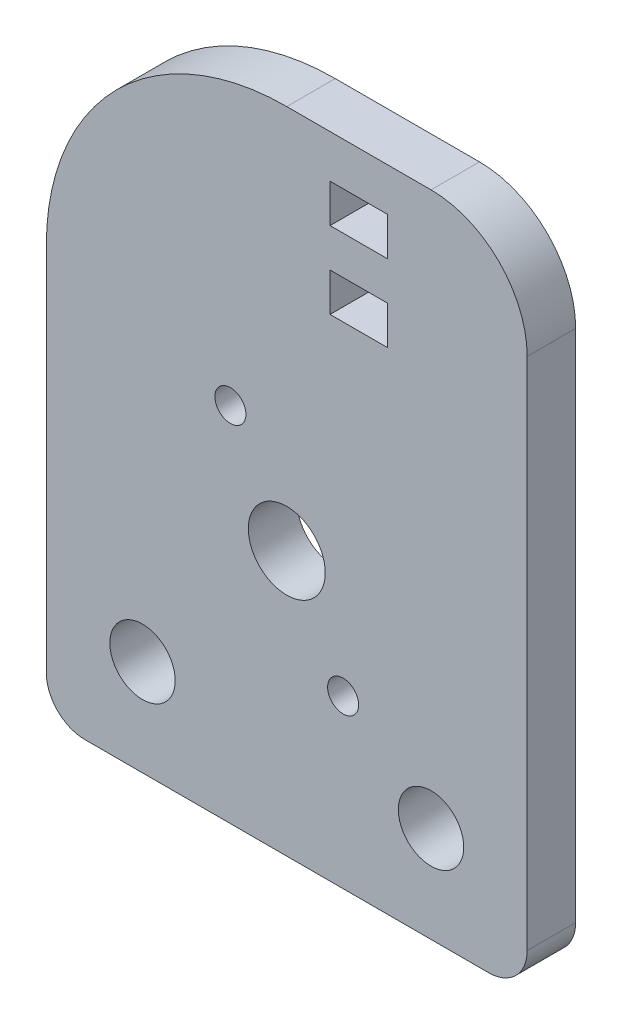
ISO-10303-21;
HEADER;
FILE_DESCRIPTION(('STEP AP214'),'2;1');
FILE_NAME('part.step','',(''),(''),'','','');
FILE_SCHEMA(('AUTOMOTIVE_DESIGN { 1 0 10303 214 1 1 1 1 }'));
ENDSEC;
DATA;
#1=APPLICATION_CONTEXT('core data for automotive mechanical design processes');
#2=APPLICATION_PROTOCOL_DEFINITION('international standard','automotive_design',2000,#1);
#3=PRODUCT_CONTEXT('',#1,'mechanical');
#4=PRODUCT('Part','Part','',(#3));
#5=PRODUCT_RELATED_PRODUCT_CATEGORY('part','',(#4));
#6=PRODUCT_DEFINITION_FORMATION('','',#4);
#7=PRODUCT_DEFINITION_CONTEXT('part definition',#1,'design');
#8=PRODUCT_DEFINITION('design','',#6,#7);
#9=PRODUCT_DEFINITION_SHAPE('','',#8);
#10=(LENGTH_UNIT() NAMED_UNIT(*) SI_UNIT(.MILLI.,.METRE.));
#11=(NAMED_UNIT(*) PLANE_ANGLE_UNIT() SI_UNIT($,.RADIAN.));
#12=(NAMED_UNIT(*) SI_UNIT($,.STERADIAN.) SOLID_ANGLE_UNIT());
#13=UNCERTAINTY_MEASURE_WITH_UNIT(LENGTH_MEASURE(1.E-05),#10,'distance_accuracy_value','');
#14=(GEOMETRIC_REPRESENTATION_CONTEXT(3) GLOBAL_UNCERTAINTY_ASSIGNED_CONTEXT((#13)) GLOBAL_UNIT_ASSIGNED_CONTEXT((#10,
#11,#12)) REPRESENTATION_CONTEXT('',''));
#15=CARTESIAN_POINT('',(0.,0.,0.));
#16=DIRECTION('',(0.,0.,1.));
#17=DIRECTION('',(1.,0.,0.));
#18=AXIS2_PLACEMENT_3D('',#15,#16,#17);
#19=CARTESIAN_POINT('',(0.,9.52500000000003,3.2004));
#20=DIRECTION('',(0.,0.,1.));
#21=DIRECTION('',(1.,0.,0.));
#22=AXIS2_PLACEMENT_3D('',#19,#20,#21);
#23=PLANE('',#22);
#24=DIRECTION('',(0.,-1.,0.));
#25=VECTOR('',#24,1.);
#26=CARTESIAN_POINT('',(2.85749999999999,22.5627854540451,3.2004));
#27=LINE('',#26,#25);
#28=CARTESIAN_POINT('',(2.85749999999999,22.5627854540451,3.2004));
#29=VERTEX_POINT('',#28);
#30=CARTESIAN_POINT('',(2.85749999999999,20.0227854540451,3.2004));
#31=VERTEX_POINT('',#30);
#32=EDGE_CURVE('E48',#29,#31,#27,.T.);
#33=ORIENTED_EDGE('',*,*,#32,.F.);
#34=DIRECTION('',(-1.,0.,0.));
#35=VECTOR('',#34,1.);
#36=CARTESIAN_POINT('',(2.85749999999999,22.5627854540451,3.2004));
#37=LINE('',#36,#35);
#38=CARTESIAN_POINT('',(6.66749999999999,22.5627854540451,3.2004));
#39=VERTEX_POINT('',#38);
#40=EDGE_CURVE('E169',#39,#29,#37,.T.);
#41=ORIENTED_EDGE('',*,*,#40,.F.);
#42=DIRECTION('',(0.,1.,0.));
#43=VECTOR('',#42,1.);
#44=CARTESIAN_POINT('',(6.66749999999999,22.5627854540451,3.2004));
#45=LINE('',#44,#43);
#46=CARTESIAN_POINT('',(6.66749999999999,20.0227854540451,3.2004));
#47=VERTEX_POINT('',#46);
#48=EDGE_CURVE('E153',#47,#39,#45,.T.);
#49=ORIENTED_EDGE('',*,*,#48,.F.);
#50=DIRECTION('',(1.,0.,0.));
#51=VECTOR('',#50,1.);
#52=CARTESIAN_POINT('',(2.85749999999999,20.0227854540451,3.2004));
#53=LINE('',#52,#51);
#54=EDGE_CURVE('E163',#31,#47,#53,.T.);
#55=ORIENTED_EDGE('',*,*,#54,.F.);
#56=EDGE_LOOP('',(#33,#41,#49,#55));
#57=FACE_BOUND('',#56,.T.);
#58=DIRECTION('',(0.,-1.,0.));
#59=VECTOR('',#58,1.);
#60=CARTESIAN_POINT('',(2.85749999999999,17.4827854540451,3.2004));
#61=LINE('',#60,#59);
#62=CARTESIAN_POINT('',(2.85749999999999,17.4827854540451,3.2004));
#63=VERTEX_POINT('',#62);
#64=CARTESIAN_POINT('',(2.85749999999999,14.9427854540451,3.2004));
#65=VERTEX_POINT('',#64);
#66=EDGE_CURVE('E56',#63,#65,#61,.T.);
#67=ORIENTED_EDGE('',*,*,#66,.F.);
#68=DIRECTION('',(-1.,0.,0.));
#69=VECTOR('',#68,1.);
#70=CARTESIAN_POINT('',(2.85749999999999,17.4827854540451,3.2004));
#71=LINE('',#70,#69);
#72=CARTESIAN_POINT('',(6.66749999999999,17.4827854540451,3.2004));
#73=VERTEX_POINT('',#72);
#74=EDGE_CURVE('E198',#73,#63,#71,.T.);
#75=ORIENTED_EDGE('',*,*,#74,.F.);
#76=DIRECTION('',(0.,1.,0.));
#77=VECTOR('',#76,1.);
#78=CARTESIAN_POINT('',(6.66749999999999,17.4827854540451,3.2004));
#79=LINE('',#78,#77);
#80=CARTESIAN_POINT('',(6.66749999999999,14.9427854540451,3.2004));
#81=VERTEX_POINT('',#80);
#82=EDGE_CURVE('E195',#81,#73,#79,.T.);
#83=ORIENTED_EDGE('',*,*,#82,.F.);
#84=DIRECTION('',(1.,0.,0.));
#85=VECTOR('',#84,1.);
#86=CARTESIAN_POINT('',(2.85749999999999,14.9427854540451,3.2004));
#87=LINE('',#86,#85);
#88=EDGE_CURVE('E192',#65,#81,#87,.T.);
#89=ORIENTED_EDGE('',*,*,#88,.F.);
#90=EDGE_LOOP('',(#67,#75,#83,#89));
#91=FACE_BOUND('',#90,.T.);
#92=CARTESIAN_POINT('',(-3.72109999999999,6.44513426004456,3.2004));
#93=DIRECTION('',(0.,0.,1.));
#94=DIRECTION('',(1.,0.,0.));
#95=AXIS2_PLACEMENT_3D('',#92,#93,#94);
#96=CIRCLE('',#95,1.025);
#97=CARTESIAN_POINT('',(-2.69609999999999,6.44513426004456,3.2004));
#98=VERTEX_POINT('',#97);
#99=EDGE_CURVE('E209',#98,#98,#96,.T.);
#100=ORIENTED_EDGE('',*,*,#99,.F.);
#101=EDGE_LOOP('',(#100));
#102=FACE_BOUND('',#101,.T.);
#103=CARTESIAN_POINT('',(3.72109999999999,-6.44513426004456,3.2004));
#104=DIRECTION('',(0.,0.,1.));
#105=DIRECTION('',(1.,0.,0.));
#106=AXIS2_PLACEMENT_3D('',#103,#104,#105);
#107=CIRCLE('',#106,1.025);
#108=CARTESIAN_POINT('',(4.74609999999999,-6.44513426004456,3.2004));
#109=VERTEX_POINT('',#108);
#110=EDGE_CURVE('E180',#109,#109,#107,.T.);
#111=ORIENTED_EDGE('',*,*,#110,.F.);
#112=EDGE_LOOP('',(#111));
#113=FACE_BOUND('',#112,.T.);
#114=CARTESIAN_POINT('',(-9.525,-11.1125,3.2004));
#115=DIRECTION('',(0.,0.,1.));
#116=DIRECTION('',(1.,0.,0.));
#117=AXIS2_PLACEMENT_3D('',#114,#115,#116);
#118=CIRCLE('',#117,2.159);
#119=CARTESIAN_POINT('',(-7.366,-11.1125,3.2004));
#120=VERTEX_POINT('',#119);
#121=EDGE_CURVE('E227',#120,#120,#118,.T.);
#122=ORIENTED_EDGE('',*,*,#121,.F.);
#123=EDGE_LOOP('',(#122));
#124=FACE_BOUND('',#123,.T.);
#125=DIRECTION('',(0.,-1.,0.));
#126=VECTOR('',#125,1.);
#127=CARTESIAN_POINT('',(-15.875,9.525,3.2004));
#128=LINE('',#127,#126);
#129=CARTESIAN_POINT('',(-15.875,9.525,3.2004));
#130=VERTEX_POINT('',#129);
#131=CARTESIAN_POINT('',(-15.875,-14.9225,3.2004));
#132=VERTEX_POINT('',#131);
#133=EDGE_CURVE('E246',#130,#132,#128,.T.);
#134=ORIENTED_EDGE('',*,*,#133,.T.);
#135=CARTESIAN_POINT('',(-13.335,-14.9225,3.2004));
#136=DIRECTION('',(0.,0.,1.));
#137=DIRECTION('',(1.,0.,0.));
#138=AXIS2_PLACEMENT_3D('',#135,#136,#137);
#139=CIRCLE('',#138,2.54);
#140=CARTESIAN_POINT('',(-13.335,-17.4625,3.2004));
#141=VERTEX_POINT('',#140);
#142=EDGE_CURVE('E41',#132,#141,#139,.T.);
#143=ORIENTED_EDGE('',*,*,#142,.T.);
#144=DIRECTION('',(1.,0.,0.));
#145=VECTOR('',#144,1.);
#146=CARTESIAN_POINT('',(-15.875,-17.4625,3.2004));
#147=LINE('',#146,#145);
#148=CARTESIAN_POINT('',(13.335,-17.4625,3.2004));
#149=VERTEX_POINT('',#148);
#150=EDGE_CURVE('E249',#141,#149,#147,.T.);
#151=ORIENTED_EDGE('',*,*,#150,.T.);
#152=CARTESIAN_POINT('',(13.335,-14.9225,3.2004));
#153=DIRECTION('',(0.,0.,1.));
#154=DIRECTION('',(1.,0.,0.));
#155=AXIS2_PLACEMENT_3D('',#152,#153,#154);
#156=CIRCLE('',#155,2.54);
#157=CARTESIAN_POINT('',(15.875,-14.9225,3.2004));
#158=VERTEX_POINT('',#157);
#159=EDGE_CURVE('E290',#149,#158,#156,.T.);
#160=ORIENTED_EDGE('',*,*,#159,.T.);
#161=DIRECTION('',(0.,1.,0.));
#162=VECTOR('',#161,1.);
#163=CARTESIAN_POINT('',(15.875,9.525,3.2004));
#164=LINE('',#163,#162);
#165=CARTESIAN_POINT('',(15.875,19.05,3.2004));
#166=VERTEX_POINT('',#165);
#167=EDGE_CURVE('E239',#158,#166,#164,.T.);
#168=ORIENTED_EDGE('',*,*,#167,.T.);
#169=CARTESIAN_POINT('',(9.525,19.05,3.2004));
#170=DIRECTION('',(0.,0.,1.));
#171=DIRECTION('',(1.,0.,0.));
#172=AXIS2_PLACEMENT_3D('',#169,#170,#171);
#173=CIRCLE('',#172,6.35);
#174=CARTESIAN_POINT('',(9.525,25.4,3.2004));
#175=VERTEX_POINT('',#174);
#176=EDGE_CURVE('E277',#166,#175,#173,.T.);
#177=ORIENTED_EDGE('',*,*,#176,.T.);
#178=DIRECTION('',(-1.,0.,0.));
#179=VECTOR('',#178,1.);
#180=CARTESIAN_POINT('',(0.,25.4,3.2004));
#181=LINE('',#180,#179);
#182=CARTESIAN_POINT('',(0.,25.4,3.2004));
#183=VERTEX_POINT('',#182);
#184=EDGE_CURVE('E241',#175,#183,#181,.T.);
#185=ORIENTED_EDGE('',*,*,#184,.T.);
#186=CARTESIAN_POINT('',(0.,9.52500000000003,3.2004));
#187=DIRECTION('',(0.,0.,1.));
#188=DIRECTION('',(1.,0.,0.));
#189=AXIS2_PLACEMENT_3D('',#186,#187,#188);
#190=CIRCLE('',#189,15.875);
#191=EDGE_CURVE('E244',#183,#130,#190,.T.);
#192=ORIENTED_EDGE('',*,*,#191,.T.);
#193=EDGE_LOOP('',(#134,#143,#151,#160,#168,#177,#185,#192));
#194=FACE_BOUND('',#193,.T.);
#195=CARTESIAN_POINT('',(0.,0.,3.2004));
#196=DIRECTION('',(0.,0.,1.));
#197=DIRECTION('',(1.,0.,0.));
#198=AXIS2_PLACEMENT_3D('',#195,#196,#197);
#199=CIRCLE('',#198,2.54);
#200=CARTESIAN_POINT('',(2.54,0.,3.2004));
#201=VERTEX_POINT('',#200);
#202=EDGE_CURVE('E233',#201,#201,#199,.T.);
#203=ORIENTED_EDGE('',*,*,#202,.F.);
#204=EDGE_LOOP('',(#203));
#205=FACE_BOUND('',#204,.T.);
#206=CARTESIAN_POINT('',(9.525,-11.1125,3.2004));
#207=DIRECTION('',(0.,0.,1.));
#208=DIRECTION('',(1.,0.,0.));
#209=AXIS2_PLACEMENT_3D('',#206,#207,#208);
#210=CIRCLE('',#209,2.159);
#211=CARTESIAN_POINT('',(11.684,-11.1125,3.2004));
#212=VERTEX_POINT('',#211);
#213=EDGE_CURVE('E221',#212,#212,#210,.T.);
#214=ORIENTED_EDGE('',*,*,#213,.F.);
#215=EDGE_LOOP('',(#214));
#216=FACE_BOUND('',#215,.T.);
#217=ADVANCED_FACE('F33',(#57,#91,#102,#113,#124,#194,#205,#216),#23,.T.);
#218=CARTESIAN_POINT('',(0.,9.52500000000003,0.));
#219=DIRECTION('',(0.,0.,1.));
#220=DIRECTION('',(1.,0.,0.));
#221=AXIS2_PLACEMENT_3D('',#218,#219,#220);
#222=PLANE('',#221);
#223=DIRECTION('',(1.,0.,0.));
#224=VECTOR('',#223,1.);
#225=CARTESIAN_POINT('',(2.85749999999999,22.5627854540451,0.));
#226=LINE('',#225,#224);
#227=CARTESIAN_POINT('',(2.85749999999999,22.5627854540451,0.));
#228=VERTEX_POINT('',#227);
#229=CARTESIAN_POINT('',(6.66749999999999,22.5627854540451,0.));
#230=VERTEX_POINT('',#229);
#231=EDGE_CURVE('E408',#228,#230,#226,.T.);
#232=ORIENTED_EDGE('',*,*,#231,.F.);
#233=DIRECTION('',(0.,1.,0.));
#234=VECTOR('',#233,1.);
#235=CARTESIAN_POINT('',(2.85749999999999,22.5627854540451,0.));
#236=LINE('',#235,#234);
#237=CARTESIAN_POINT('',(2.85749999999999,20.0227854540451,0.));
#238=VERTEX_POINT('',#237);
#239=EDGE_CURVE('E181',#238,#228,#236,.T.);
#240=ORIENTED_EDGE('',*,*,#239,.F.);
#241=DIRECTION('',(-1.,0.,0.));
#242=VECTOR('',#241,1.);
#243=CARTESIAN_POINT('',(2.85749999999999,20.0227854540451,0.));
#244=LINE('',#243,#242);
#245=CARTESIAN_POINT('',(6.66749999999999,20.0227854540451,0.));
#246=VERTEX_POINT('',#245);
#247=EDGE_CURVE('E178',#246,#238,#244,.T.);
#248=ORIENTED_EDGE('',*,*,#247,.F.);
#249=DIRECTION('',(0.,-1.,0.));
#250=VECTOR('',#249,1.);
#251=CARTESIAN_POINT('',(6.66749999999999,22.5627854540451,0.));
#252=LINE('',#251,#250);
#253=EDGE_CURVE('E156',#230,#246,#252,.T.);
#254=ORIENTED_EDGE('',*,*,#253,.F.);
#255=EDGE_LOOP('',(#232,#240,#248,#254));
#256=FACE_BOUND('',#255,.T.);
#257=DIRECTION('',(1.,0.,0.));
#258=VECTOR('',#257,1.);
#259=CARTESIAN_POINT('',(2.85749999999999,17.4827854540451,0.));
#260=LINE('',#259,#258);
#261=CARTESIAN_POINT('',(2.85749999999999,17.4827854540451,0.));
#262=VERTEX_POINT('',#261);
#263=CARTESIAN_POINT('',(6.66749999999999,17.4827854540451,0.));
#264=VERTEX_POINT('',#263);
#265=EDGE_CURVE('E185',#262,#264,#260,.T.);
#266=ORIENTED_EDGE('',*,*,#265,.F.);
#267=DIRECTION('',(0.,1.,0.));
#268=VECTOR('',#267,1.);
#269=CARTESIAN_POINT('',(2.85749999999999,17.4827854540451,0.));
#270=LINE('',#269,#268);
#271=CARTESIAN_POINT('',(2.85749999999999,14.9427854540451,0.));
#272=VERTEX_POINT('',#271);
#273=EDGE_CURVE('E188',#272,#262,#270,.T.);
#274=ORIENTED_EDGE('',*,*,#273,.F.);
#275=DIRECTION('',(-1.,0.,0.));
#276=VECTOR('',#275,1.);
#277=CARTESIAN_POINT('',(2.85749999999999,14.9427854540451,0.));
#278=LINE('',#277,#276);
#279=CARTESIAN_POINT('',(6.66749999999999,14.9427854540451,0.));
#280=VERTEX_POINT('',#279);
#281=EDGE_CURVE('E190',#280,#272,#278,.T.);
#282=ORIENTED_EDGE('',*,*,#281,.F.);
#283=DIRECTION('',(0.,-1.,0.));
#284=VECTOR('',#283,1.);
#285=CARTESIAN_POINT('',(6.66749999999999,17.4827854540451,0.));
#286=LINE('',#285,#284);
#287=EDGE_CURVE('E182',#264,#280,#286,.T.);
#288=ORIENTED_EDGE('',*,*,#287,.F.);
#289=EDGE_LOOP('',(#266,#274,#282,#288));
#290=FACE_BOUND('',#289,.T.);
#291=CARTESIAN_POINT('',(-3.72109999999999,6.44513426004456,0.));
#292=DIRECTION('',(0.,0.,1.));
#293=DIRECTION('',(1.,0.,0.));
#294=AXIS2_PLACEMENT_3D('',#291,#292,#293);
#295=CIRCLE('',#294,1.025);
#296=CARTESIAN_POINT('',(-2.69609999999999,6.44513426004456,0.));
#297=VERTEX_POINT('',#296);
#298=EDGE_CURVE('E212',#297,#297,#295,.F.);
#299=ORIENTED_EDGE('',*,*,#298,.F.);
#300=EDGE_LOOP('',(#299));
#301=FACE_BOUND('',#300,.T.);
#302=CARTESIAN_POINT('',(3.72109999999999,-6.44513426004456,0.));
#303=DIRECTION('',(0.,0.,1.));
#304=DIRECTION('',(1.,0.,0.));
#305=AXIS2_PLACEMENT_3D('',#302,#303,#304);
#306=CIRCLE('',#305,1.025);
#307=CARTESIAN_POINT('',(4.74609999999999,-6.44513426004456,0.));
#308=VERTEX_POINT('',#307);
#309=EDGE_CURVE('E213',#308,#308,#306,.F.);
#310=ORIENTED_EDGE('',*,*,#309,.F.);
#311=EDGE_LOOP('',(#310));
#312=FACE_BOUND('',#311,.T.);
#313=DIRECTION('',(1.,0.,0.));
#314=VECTOR('',#313,1.);
#315=CARTESIAN_POINT('',(-15.875,-17.4625,0.));
#316=LINE('',#315,#314);
#317=CARTESIAN_POINT('',(-13.335,-17.4625,0.));
#318=VERTEX_POINT('',#317);
#319=CARTESIAN_POINT('',(13.335,-17.4625,0.));
#320=VERTEX_POINT('',#319);
#321=EDGE_CURVE('E242',#318,#320,#316,.T.);
#322=ORIENTED_EDGE('',*,*,#321,.F.);
#323=CARTESIAN_POINT('',(-13.335,-14.9225,0.));
#324=DIRECTION('',(0.,0.,1.));
#325=DIRECTION('',(1.,0.,0.));
#326=AXIS2_PLACEMENT_3D('',#323,#324,#325);
#327=CIRCLE('',#326,2.54);
#328=CARTESIAN_POINT('',(-15.875,-14.9225,0.));
#329=VERTEX_POINT('',#328);
#330=EDGE_CURVE('E286',#318,#329,#327,.F.);
#331=ORIENTED_EDGE('',*,*,#330,.T.);
#332=DIRECTION('',(0.,-1.,0.));
#333=VECTOR('',#332,1.);
#334=CARTESIAN_POINT('',(-15.875,9.525,0.));
#335=LINE('',#334,#333);
#336=CARTESIAN_POINT('',(-15.875,9.525,0.));
#337=VERTEX_POINT('',#336);
#338=EDGE_CURVE('E258',#337,#329,#335,.T.);
#339=ORIENTED_EDGE('',*,*,#338,.F.);
#340=CARTESIAN_POINT('',(0.,9.52500000000003,0.));
#341=DIRECTION('',(0.,0.,1.));
#342=DIRECTION('',(1.,0.,0.));
#343=AXIS2_PLACEMENT_3D('',#340,#341,#342);
#344=CIRCLE('',#343,15.875);
#345=CARTESIAN_POINT('',(0.,25.4,0.));
#346=VERTEX_POINT('',#345);
#347=EDGE_CURVE('E256',#346,#337,#344,.T.);
#348=ORIENTED_EDGE('',*,*,#347,.F.);
#349=DIRECTION('',(-1.,0.,0.));
#350=VECTOR('',#349,1.);
#351=CARTESIAN_POINT('',(0.,25.4,0.));
#352=LINE('',#351,#350);
#353=CARTESIAN_POINT('',(9.525,25.4,0.));
#354=VERTEX_POINT('',#353);
#355=EDGE_CURVE('E254',#354,#346,#352,.T.);
#356=ORIENTED_EDGE('',*,*,#355,.F.);
#357=CARTESIAN_POINT('',(9.525,19.05,0.));
#358=DIRECTION('',(0.,0.,1.));
#359=DIRECTION('',(1.,0.,0.));
#360=AXIS2_PLACEMENT_3D('',#357,#358,#359);
#361=CIRCLE('',#360,6.35);
#362=CARTESIAN_POINT('',(15.875,19.05,0.));
#363=VERTEX_POINT('',#362);
#364=EDGE_CURVE('E271',#354,#363,#361,.F.);
#365=ORIENTED_EDGE('',*,*,#364,.T.);
#366=DIRECTION('',(0.,1.,0.));
#367=VECTOR('',#366,1.);
#368=CARTESIAN_POINT('',(15.875,25.4,0.));
#369=LINE('',#368,#367);
#370=CARTESIAN_POINT('',(15.875,-14.9225,0.));
#371=VERTEX_POINT('',#370);
#372=EDGE_CURVE('E236',#371,#363,#369,.T.);
#373=ORIENTED_EDGE('',*,*,#372,.F.);
#374=CARTESIAN_POINT('',(13.335,-14.9225,0.));
#375=DIRECTION('',(0.,0.,1.));
#376=DIRECTION('',(1.,0.,0.));
#377=AXIS2_PLACEMENT_3D('',#374,#375,#376);
#378=CIRCLE('',#377,2.54);
#379=EDGE_CURVE('E284',#371,#320,#378,.F.);
#380=ORIENTED_EDGE('',*,*,#379,.T.);
#381=EDGE_LOOP('',(#322,#331,#339,#348,#356,#365,#373,#380));
#382=FACE_BOUND('',#381,.T.);
#383=CARTESIAN_POINT('',(0.,0.,0.));
#384=DIRECTION('',(0.,0.,1.));
#385=DIRECTION('',(1.,0.,0.));
#386=AXIS2_PLACEMENT_3D('',#383,#384,#385);
#387=CIRCLE('',#386,2.54);
#388=CARTESIAN_POINT('',(2.54,0.,0.));
#389=VERTEX_POINT('',#388);
#390=EDGE_CURVE('E230',#389,#389,#387,.T.);
#391=ORIENTED_EDGE('',*,*,#390,.T.);
#392=EDGE_LOOP('',(#391));
#393=FACE_BOUND('',#392,.T.);
#394=CARTESIAN_POINT('',(-9.525,-11.1125,0.));
#395=DIRECTION('',(0.,0.,1.));
#396=DIRECTION('',(1.,0.,0.));
#397=AXIS2_PLACEMENT_3D('',#394,#395,#396);
#398=CIRCLE('',#397,2.159);
#399=CARTESIAN_POINT('',(-7.366,-11.1125,0.));
#400=VERTEX_POINT('',#399);
#401=EDGE_CURVE('E224',#400,#400,#398,.T.);
#402=ORIENTED_EDGE('',*,*,#401,.T.);
#403=EDGE_LOOP('',(#402));
#404=FACE_BOUND('',#403,.T.);
#405=CARTESIAN_POINT('',(9.525,-11.1125,0.));
#406=DIRECTION('',(0.,0.,1.));
#407=DIRECTION('',(1.,0.,0.));
#408=AXIS2_PLACEMENT_3D('',#405,#406,#407);
#409=CIRCLE('',#408,2.159);
#410=CARTESIAN_POINT('',(11.684,-11.1125,0.));
#411=VERTEX_POINT('',#410);
#412=EDGE_CURVE('E216',#411,#411,#409,.T.);
#413=ORIENTED_EDGE('',*,*,#412,.T.);
#414=EDGE_LOOP('',(#413));
#415=FACE_BOUND('',#414,.T.);
#416=ADVANCED_FACE('F307',(#256,#290,#301,#312,#382,#393,#404,#415),#222,.F.);
#417=CARTESIAN_POINT('',(15.875,25.4,3.2004));
#418=DIRECTION('',(-1.,0.,0.));
#419=DIRECTION('',(0.,-1.,0.));
#420=AXIS2_PLACEMENT_3D('',#417,#418,#419);
#421=PLANE('',#420);
#422=ORIENTED_EDGE('',*,*,#167,.F.);
#423=DIRECTION('',(0.,0.,-1.));
#424=VECTOR('',#423,1.);
#425=CARTESIAN_POINT('',(15.875,-14.9225,3.2004));
#426=LINE('',#425,#424);
#427=EDGE_CURVE('E11',#158,#371,#426,.T.);
#428=ORIENTED_EDGE('',*,*,#427,.T.);
#429=ORIENTED_EDGE('',*,*,#372,.T.);
#430=DIRECTION('',(0.,0.,-1.));
#431=VECTOR('',#430,1.);
#432=CARTESIAN_POINT('',(15.875,19.05,3.2004));
#433=LINE('',#432,#431);
#434=EDGE_CURVE('E274',#363,#166,#433,.F.);
#435=ORIENTED_EDGE('',*,*,#434,.T.);
#436=EDGE_LOOP('',(#422,#428,#429,#435));
#437=FACE_BOUND('',#436,.T.);
#438=ADVANCED_FACE('F329',(#437),#421,.F.);
#439=CARTESIAN_POINT('',(0.,25.4,3.2004));
#440=DIRECTION('',(0.,-1.,0.));
#441=DIRECTION('',(0.,0.,-1.));
#442=AXIS2_PLACEMENT_3D('',#439,#440,#441);
#443=PLANE('',#442);
#444=ORIENTED_EDGE('',*,*,#184,.F.);
#445=DIRECTION('',(0.,0.,-1.));
#446=VECTOR('',#445,1.);
#447=CARTESIAN_POINT('',(9.525,25.4,3.2004));
#448=LINE('',#447,#446);
#449=EDGE_CURVE('E268',#175,#354,#448,.T.);
#450=ORIENTED_EDGE('',*,*,#449,.T.);
#451=ORIENTED_EDGE('',*,*,#355,.T.);
#452=DIRECTION('',(0.,0.,-1.));
#453=VECTOR('',#452,1.);
#454=CARTESIAN_POINT('',(0.,25.4,3.2004));
#455=LINE('',#454,#453);
#456=EDGE_CURVE('E265',#183,#346,#455,.T.);
#457=ORIENTED_EDGE('',*,*,#456,.F.);
#458=EDGE_LOOP('',(#444,#450,#451,#457));
#459=FACE_BOUND('',#458,.T.);
#460=ADVANCED_FACE('F322',(#459),#443,.F.);
#461=CARTESIAN_POINT('',(0.,9.52500000000003,3.2004));
#462=DIRECTION('',(0.,0.,-1.));
#463=DIRECTION('',(-1.,0.,0.));
#464=AXIS2_PLACEMENT_3D('',#461,#462,#463);
#465=CYLINDRICAL_SURFACE('',#464,15.875);
#466=ORIENTED_EDGE('',*,*,#347,.T.);
#467=DIRECTION('',(0.,0.,-1.));
#468=VECTOR('',#467,1.);
#469=CARTESIAN_POINT('',(-15.875,9.525,3.2004));
#470=LINE('',#469,#468);
#471=EDGE_CURVE('E252',#130,#337,#470,.T.);
#472=ORIENTED_EDGE('',*,*,#471,.F.);
#473=ORIENTED_EDGE('',*,*,#191,.F.);
#474=ORIENTED_EDGE('',*,*,#456,.T.);
#475=EDGE_LOOP('',(#466,#472,#473,#474));
#476=FACE_BOUND('',#475,.T.);
#477=ADVANCED_FACE('F315',(#476),#465,.T.);
#478=CARTESIAN_POINT('',(-15.875,9.525,3.2004));
#479=DIRECTION('',(1.,0.,0.));
#480=DIRECTION('',(0.,1.,0.));
#481=AXIS2_PLACEMENT_3D('',#478,#479,#480);
#482=PLANE('',#481);
#483=ORIENTED_EDGE('',*,*,#338,.T.);
#484=DIRECTION('',(0.,0.,-1.));
#485=VECTOR('',#484,1.);
#486=CARTESIAN_POINT('',(-15.875,-14.9225,3.2004));
#487=LINE('',#486,#485);
#488=EDGE_CURVE('E288',#329,#132,#487,.F.);
#489=ORIENTED_EDGE('',*,*,#488,.T.);
#490=ORIENTED_EDGE('',*,*,#133,.F.);
#491=ORIENTED_EDGE('',*,*,#471,.T.);
#492=EDGE_LOOP('',(#483,#489,#490,#491));
#493=FACE_BOUND('',#492,.T.);
#494=ADVANCED_FACE('F311',(#493),#482,.F.);
#495=CARTESIAN_POINT('',(-15.875,-17.4625,3.2004));
#496=DIRECTION('',(0.,1.,0.));
#497=DIRECTION('',(-1.,0.,0.));
#498=AXIS2_PLACEMENT_3D('',#495,#496,#497);
#499=PLANE('',#498);
#500=ORIENTED_EDGE('',*,*,#150,.F.);
#501=DIRECTION('',(0.,0.,-1.));
#502=VECTOR('',#501,1.);
#503=CARTESIAN_POINT('',(-13.335,-17.4625,3.2004));
#504=LINE('',#503,#502);
#505=EDGE_CURVE('E281',#141,#318,#504,.T.);
#506=ORIENTED_EDGE('',*,*,#505,.T.);
#507=ORIENTED_EDGE('',*,*,#321,.T.);
#508=DIRECTION('',(0.,0.,-1.));
#509=VECTOR('',#508,1.);
#510=CARTESIAN_POINT('',(13.335,-17.4625,3.2004));
#511=LINE('',#510,#509);
#512=EDGE_CURVE('E279',#320,#149,#511,.F.);
#513=ORIENTED_EDGE('',*,*,#512,.T.);
#514=EDGE_LOOP('',(#500,#506,#507,#513));
#515=FACE_BOUND('',#514,.T.);
#516=ADVANCED_FACE('F301',(#515),#499,.F.);
#517=CARTESIAN_POINT('',(0.,0.,3.2004));
#518=DIRECTION('',(0.,0.,-1.));
#519=DIRECTION('',(-1.,0.,0.));
#520=AXIS2_PLACEMENT_3D('',#517,#518,#519);
#521=CYLINDRICAL_SURFACE('',#520,2.54);
#522=ORIENTED_EDGE('',*,*,#202,.T.);
#523=EDGE_LOOP('',(#522));
#524=FACE_BOUND('',#523,.T.);
#525=ORIENTED_EDGE('',*,*,#390,.F.);
#526=EDGE_LOOP('',(#525));
#527=FACE_BOUND('',#526,.T.);
#528=ADVANCED_FACE('F349',(#524,#527),#521,.F.);
#529=CARTESIAN_POINT('',(-9.525,-11.1125,3.2004));
#530=DIRECTION('',(0.,0.,-1.));
#531=DIRECTION('',(-1.,0.,0.));
#532=AXIS2_PLACEMENT_3D('',#529,#530,#531);
#533=CYLINDRICAL_SURFACE('',#532,2.159);
#534=ORIENTED_EDGE('',*,*,#121,.T.);
#535=EDGE_LOOP('',(#534));
#536=FACE_BOUND('',#535,.T.);
#537=ORIENTED_EDGE('',*,*,#401,.F.);
#538=EDGE_LOOP('',(#537));
#539=FACE_BOUND('',#538,.T.);
#540=ADVANCED_FACE('F367',(#536,#539),#533,.F.);
#541=CARTESIAN_POINT('',(9.525,-11.1125,3.2004));
#542=DIRECTION('',(0.,0.,-1.));
#543=DIRECTION('',(-1.,0.,0.));
#544=AXIS2_PLACEMENT_3D('',#541,#542,#543);
#545=CYLINDRICAL_SURFACE('',#544,2.159);
#546=ORIENTED_EDGE('',*,*,#213,.T.);
#547=EDGE_LOOP('',(#546));
#548=FACE_BOUND('',#547,.T.);
#549=ORIENTED_EDGE('',*,*,#412,.F.);
#550=EDGE_LOOP('',(#549));
#551=FACE_BOUND('',#550,.T.);
#552=ADVANCED_FACE('F363',(#548,#551),#545,.F.);
#553=CARTESIAN_POINT('',(9.525,19.05,3.2004));
#554=DIRECTION('',(0.,0.,-1.));
#555=DIRECTION('',(-1.,0.,0.));
#556=AXIS2_PLACEMENT_3D('',#553,#554,#555);
#557=CYLINDRICAL_SURFACE('',#556,6.35);
#558=ORIENTED_EDGE('',*,*,#176,.F.);
#559=ORIENTED_EDGE('',*,*,#434,.F.);
#560=ORIENTED_EDGE('',*,*,#364,.F.);
#561=ORIENTED_EDGE('',*,*,#449,.F.);
#562=EDGE_LOOP('',(#558,#559,#560,#561));
#563=FACE_BOUND('',#562,.T.);
#564=ADVANCED_FACE('F326',(#563),#557,.T.);
#565=CARTESIAN_POINT('',(-13.335,-14.9225,3.2004));
#566=DIRECTION('',(0.,0.,-1.));
#567=DIRECTION('',(-1.,0.,0.));
#568=AXIS2_PLACEMENT_3D('',#565,#566,#567);
#569=CYLINDRICAL_SURFACE('',#568,2.54);
#570=ORIENTED_EDGE('',*,*,#142,.F.);
#571=ORIENTED_EDGE('',*,*,#488,.F.);
#572=ORIENTED_EDGE('',*,*,#330,.F.);
#573=ORIENTED_EDGE('',*,*,#505,.F.);
#574=EDGE_LOOP('',(#570,#571,#572,#573));
#575=FACE_BOUND('',#574,.T.);
#576=ADVANCED_FACE('F304',(#575),#569,.T.);
#577=CARTESIAN_POINT('',(13.335,-14.9225,3.2004));
#578=DIRECTION('',(0.,0.,-1.));
#579=DIRECTION('',(-1.,0.,0.));
#580=AXIS2_PLACEMENT_3D('',#577,#578,#579);
#581=CYLINDRICAL_SURFACE('',#580,2.54);
#582=ORIENTED_EDGE('',*,*,#159,.F.);
#583=ORIENTED_EDGE('',*,*,#512,.F.);
#584=ORIENTED_EDGE('',*,*,#379,.F.);
#585=ORIENTED_EDGE('',*,*,#427,.F.);
#586=EDGE_LOOP('',(#582,#583,#584,#585));
#587=FACE_BOUND('',#586,.T.);
#588=ADVANCED_FACE('F35',(#587),#581,.T.);
#589=CARTESIAN_POINT('',(3.72109999999999,-6.44513426004456,-2.89913780286484));
#590=DIRECTION('',(0.,0.,1.));
#591=DIRECTION('',(1.,0.,0.));
#592=AXIS2_PLACEMENT_3D('',#589,#590,#591);
#593=CYLINDRICAL_SURFACE('',#592,1.025);
#594=ORIENTED_EDGE('',*,*,#309,.T.);
#595=EDGE_LOOP('',(#594));
#596=FACE_BOUND('',#595,.T.);
#597=ORIENTED_EDGE('',*,*,#110,.T.);
#598=EDGE_LOOP('',(#597));
#599=FACE_BOUND('',#598,.T.);
#600=ADVANCED_FACE('F333',(#596,#599),#593,.F.);
#601=CARTESIAN_POINT('',(-3.72109999999999,6.44513426004456,-2.89913780286484));
#602=DIRECTION('',(0.,0.,1.));
#603=DIRECTION('',(1.,0.,0.));
#604=AXIS2_PLACEMENT_3D('',#601,#602,#603);
#605=CYLINDRICAL_SURFACE('',#604,1.025);
#606=ORIENTED_EDGE('',*,*,#298,.T.);
#607=EDGE_LOOP('',(#606));
#608=FACE_BOUND('',#607,.T.);
#609=ORIENTED_EDGE('',*,*,#99,.T.);
#610=EDGE_LOOP('',(#609));
#611=FACE_BOUND('',#610,.T.);
#612=ADVANCED_FACE('F338',(#608,#611),#605,.F.);
#613=CARTESIAN_POINT('',(2.85749999999999,17.4827854540451,-4.57905011983927));
#614=DIRECTION('',(-1.,0.,0.));
#615=DIRECTION('',(0.,-1.,0.));
#616=AXIS2_PLACEMENT_3D('',#613,#614,#615);
#617=PLANE('',#616);
#618=ORIENTED_EDGE('',*,*,#273,.T.);
#619=DIRECTION('',(0.,0.,1.));
#620=VECTOR('',#619,1.);
#621=CARTESIAN_POINT('',(2.85749999999999,17.4827854540451,-4.57905011983927));
#622=LINE('',#621,#620);
#623=EDGE_CURVE('E186',#262,#63,#622,.T.);
#624=ORIENTED_EDGE('',*,*,#623,.T.);
#625=ORIENTED_EDGE('',*,*,#66,.T.);
#626=DIRECTION('',(0.,0.,1.));
#627=VECTOR('',#626,1.);
#628=CARTESIAN_POINT('',(2.85749999999999,14.9427854540451,-4.57905011983927));
#629=LINE('',#628,#627);
#630=EDGE_CURVE('E201',#272,#65,#629,.T.);
#631=ORIENTED_EDGE('',*,*,#630,.F.);
#632=EDGE_LOOP('',(#618,#624,#625,#631));
#633=FACE_BOUND('',#632,.T.);
#634=ADVANCED_FACE('F378',(#633),#617,.F.);
#635=CARTESIAN_POINT('',(2.85749999999999,17.4827854540451,-4.57905011983927));
#636=DIRECTION('',(0.,1.,0.));
#637=DIRECTION('',(-1.,0.,0.));
#638=AXIS2_PLACEMENT_3D('',#635,#636,#637);
#639=PLANE('',#638);
#640=ORIENTED_EDGE('',*,*,#265,.T.);
#641=DIRECTION('',(0.,0.,1.));
#642=VECTOR('',#641,1.);
#643=CARTESIAN_POINT('',(6.66749999999999,17.4827854540451,-4.57905011983927));
#644=LINE('',#643,#642);
#645=EDGE_CURVE('E203',#264,#73,#644,.T.);
#646=ORIENTED_EDGE('',*,*,#645,.T.);
#647=ORIENTED_EDGE('',*,*,#74,.T.);
#648=ORIENTED_EDGE('',*,*,#623,.F.);
#649=EDGE_LOOP('',(#640,#646,#647,#648));
#650=FACE_BOUND('',#649,.T.);
#651=ADVANCED_FACE('F382',(#650),#639,.F.);
#652=CARTESIAN_POINT('',(6.66749999999999,17.4827854540451,-4.57905011983927));
#653=DIRECTION('',(1.,0.,0.));
#654=DIRECTION('',(0.,1.,0.));
#655=AXIS2_PLACEMENT_3D('',#652,#653,#654);
#656=PLANE('',#655);
#657=ORIENTED_EDGE('',*,*,#287,.T.);
#658=DIRECTION('',(0.,0.,1.));
#659=VECTOR('',#658,1.);
#660=CARTESIAN_POINT('',(6.66749999999999,14.9427854540451,-4.57905011983927));
#661=LINE('',#660,#659);
#662=EDGE_CURVE('E205',#280,#81,#661,.T.);
#663=ORIENTED_EDGE('',*,*,#662,.T.);
#664=ORIENTED_EDGE('',*,*,#82,.T.);
#665=ORIENTED_EDGE('',*,*,#645,.F.);
#666=EDGE_LOOP('',(#657,#663,#664,#665));
#667=FACE_BOUND('',#666,.T.);
#668=ADVANCED_FACE('F387',(#667),#656,.F.);
#669=CARTESIAN_POINT('',(2.85749999999999,14.9427854540451,-4.57905011983927));
#670=DIRECTION('',(0.,-1.,0.));
#671=DIRECTION('',(0.,0.,-1.));
#672=AXIS2_PLACEMENT_3D('',#669,#670,#671);
#673=PLANE('',#672);
#674=ORIENTED_EDGE('',*,*,#281,.T.);
#675=ORIENTED_EDGE('',*,*,#630,.T.);
#676=ORIENTED_EDGE('',*,*,#88,.T.);
#677=ORIENTED_EDGE('',*,*,#662,.F.);
#678=EDGE_LOOP('',(#674,#675,#676,#677));
#679=FACE_BOUND('',#678,.T.);
#680=ADVANCED_FACE('F383',(#679),#673,.F.);
#681=CARTESIAN_POINT('',(2.85749999999999,22.5627854540451,-4.57905011983927));
#682=DIRECTION('',(-1.,0.,0.));
#683=DIRECTION('',(0.,-1.,0.));
#684=AXIS2_PLACEMENT_3D('',#681,#682,#683);
#685=PLANE('',#684);
#686=ORIENTED_EDGE('',*,*,#239,.T.);
#687=DIRECTION('',(0.,0.,1.));
#688=VECTOR('',#687,1.);
#689=CARTESIAN_POINT('',(2.85749999999999,22.5627854540451,-4.57905011983927));
#690=LINE('',#689,#688);
#691=EDGE_CURVE('E174',#228,#29,#690,.T.);
#692=ORIENTED_EDGE('',*,*,#691,.T.);
#693=ORIENTED_EDGE('',*,*,#32,.T.);
#694=DIRECTION('',(0.,0.,1.));
#695=VECTOR('',#694,1.);
#696=CARTESIAN_POINT('',(2.85749999999999,20.0227854540451,-4.57905011983927));
#697=LINE('',#696,#695);
#698=EDGE_CURVE('E160',#238,#31,#697,.T.);
#699=ORIENTED_EDGE('',*,*,#698,.F.);
#700=EDGE_LOOP('',(#686,#692,#693,#699));
#701=FACE_BOUND('',#700,.T.);
#702=ADVANCED_FACE('F386',(#701),#685,.F.);
#703=CARTESIAN_POINT('',(2.85749999999999,22.5627854540451,-4.57905011983927));
#704=DIRECTION('',(0.,1.,0.));
#705=DIRECTION('',(0.,0.,1.));
#706=AXIS2_PLACEMENT_3D('',#703,#704,#705);
#707=PLANE('',#706);
#708=ORIENTED_EDGE('',*,*,#231,.T.);
#709=DIRECTION('',(0.,0.,1.));
#710=VECTOR('',#709,1.);
#711=CARTESIAN_POINT('',(6.66749999999999,22.5627854540451,-4.57905011983927));
#712=LINE('',#711,#710);
#713=EDGE_CURVE('E159',#230,#39,#712,.T.);
#714=ORIENTED_EDGE('',*,*,#713,.T.);
#715=ORIENTED_EDGE('',*,*,#40,.T.);
#716=ORIENTED_EDGE('',*,*,#691,.F.);
#717=EDGE_LOOP('',(#708,#714,#715,#716));
#718=FACE_BOUND('',#717,.T.);
#719=ADVANCED_FACE('F397',(#718),#707,.F.);
#720=CARTESIAN_POINT('',(6.66749999999999,22.5627854540451,-4.57905011983927));
#721=DIRECTION('',(1.,0.,0.));
#722=DIRECTION('',(0.,1.,0.));
#723=AXIS2_PLACEMENT_3D('',#720,#721,#722);
#724=PLANE('',#723);
#725=ORIENTED_EDGE('',*,*,#253,.T.);
#726=DIRECTION('',(0.,0.,1.));
#727=VECTOR('',#726,1.);
#728=CARTESIAN_POINT('',(6.66749999999999,20.0227854540451,-4.57905011983927));
#729=LINE('',#728,#727);
#730=EDGE_CURVE('E148',#246,#47,#729,.T.);
#731=ORIENTED_EDGE('',*,*,#730,.T.);
#732=ORIENTED_EDGE('',*,*,#48,.T.);
#733=ORIENTED_EDGE('',*,*,#713,.F.);
#734=EDGE_LOOP('',(#725,#731,#732,#733));
#735=FACE_BOUND('',#734,.T.);
#736=ADVANCED_FACE('F150',(#735),#724,.F.);
#737=CARTESIAN_POINT('',(2.85749999999999,20.0227854540451,-4.57905011983927));
#738=DIRECTION('',(0.,-1.,0.));
#739=DIRECTION('',(1.,0.,0.));
#740=AXIS2_PLACEMENT_3D('',#737,#738,#739);
#741=PLANE('',#740);
#742=ORIENTED_EDGE('',*,*,#247,.T.);
#743=ORIENTED_EDGE('',*,*,#698,.T.);
#744=ORIENTED_EDGE('',*,*,#54,.T.);
#745=ORIENTED_EDGE('',*,*,#730,.F.);
#746=EDGE_LOOP('',(#742,#743,#744,#745));
#747=FACE_BOUND('',#746,.T.);
#748=ADVANCED_FACE('F164',(#747),#741,.F.);
#749=CLOSED_SHELL('',(#217,#416,#438,#460,#477,#494,#516,#528,#540,#552,#564,#576,#588,#600,
#612,#634,#651,#668,#680,#702,#719,#736,#748));
#750=MANIFOLD_SOLID_BREP('B2',#749);
#751=ADVANCED_BREP_SHAPE_REPRESENTATION('',(#18,#750),#14);
#752=SHAPE_DEFINITION_REPRESENTATION(#9,#751);
ENDSEC;
END-ISO-10303-21;
